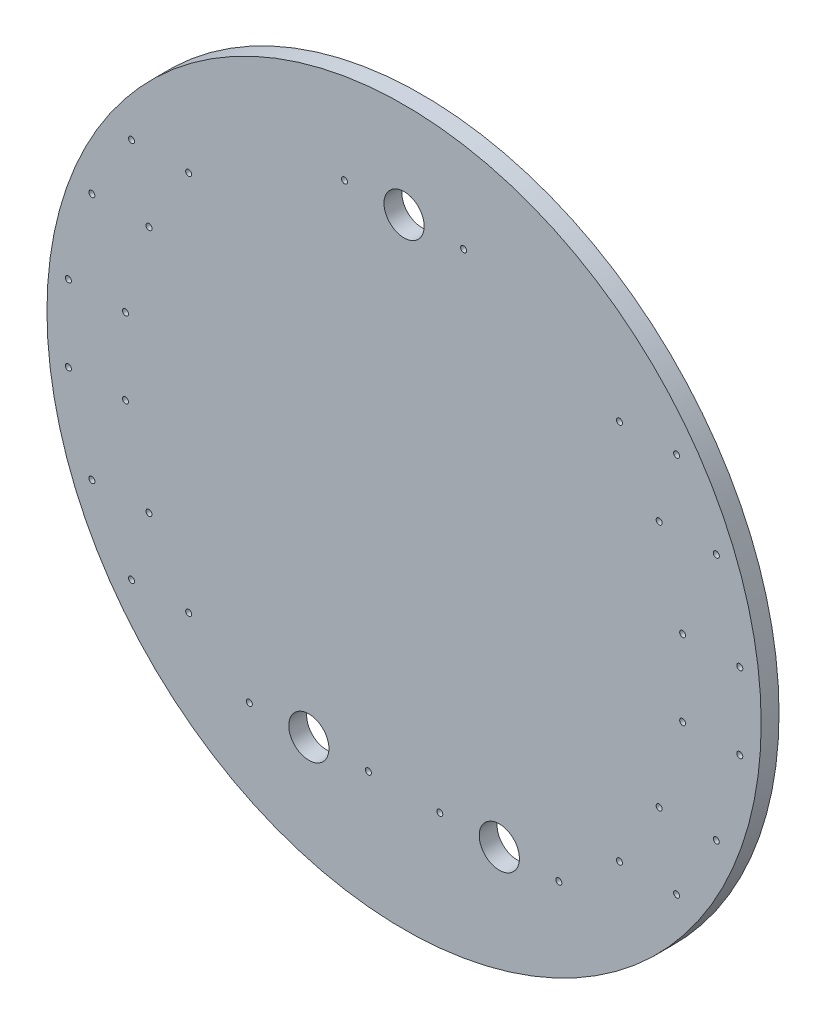
ISO-10303-21;
HEADER;
FILE_DESCRIPTION(('STEP AP214'),'2;1');
FILE_NAME('part.step','',(''),(''),'','','');
FILE_SCHEMA(('AUTOMOTIVE_DESIGN { 1 0 10303 214 1 1 1 1 }'));
ENDSEC;
DATA;
#1=APPLICATION_CONTEXT('core data for automotive mechanical design processes');
#2=APPLICATION_PROTOCOL_DEFINITION('international standard','automotive_design',2000,#1);
#3=PRODUCT_CONTEXT('',#1,'mechanical');
#4=PRODUCT('Part','Part','',(#3));
#5=PRODUCT_RELATED_PRODUCT_CATEGORY('part','',(#4));
#6=PRODUCT_DEFINITION_FORMATION('','',#4);
#7=PRODUCT_DEFINITION_CONTEXT('part definition',#1,'design');
#8=PRODUCT_DEFINITION('design','',#6,#7);
#9=PRODUCT_DEFINITION_SHAPE('','',#8);
#10=(LENGTH_UNIT() NAMED_UNIT(*) SI_UNIT(.MILLI.,.METRE.));
#11=(NAMED_UNIT(*) PLANE_ANGLE_UNIT() SI_UNIT($,.RADIAN.));
#12=(NAMED_UNIT(*) SI_UNIT($,.STERADIAN.) SOLID_ANGLE_UNIT());
#13=UNCERTAINTY_MEASURE_WITH_UNIT(LENGTH_MEASURE(1.E-05),#10,'distance_accuracy_value','');
#14=(GEOMETRIC_REPRESENTATION_CONTEXT(3) GLOBAL_UNCERTAINTY_ASSIGNED_CONTEXT((#13)) GLOBAL_UNIT_ASSIGNED_CONTEXT((#10,
#11,#12)) REPRESENTATION_CONTEXT('',''));
#15=CARTESIAN_POINT('',(0.,0.,0.));
#16=DIRECTION('',(0.,0.,1.));
#17=DIRECTION('',(1.,0.,0.));
#18=AXIS2_PLACEMENT_3D('',#15,#16,#17);
#19=CARTESIAN_POINT('',(0.,0.,4.7625));
#20=DIRECTION('',(0.,0.,-1.));
#21=DIRECTION('',(-1.,0.,0.));
#22=AXIS2_PLACEMENT_3D('',#19,#20,#21);
#23=CYLINDRICAL_SURFACE('',#22,95.25);
#24=CARTESIAN_POINT('',(0.,0.,4.7625));
#25=DIRECTION('',(0.,0.,1.));
#26=DIRECTION('',(1.,0.,0.));
#27=AXIS2_PLACEMENT_3D('',#24,#25,#26);
#28=CIRCLE('',#27,95.25);
#29=CARTESIAN_POINT('',(95.25,0.,4.7625));
#30=VERTEX_POINT('',#29);
#31=EDGE_CURVE('E10',#30,#30,#28,.T.);
#32=ORIENTED_EDGE('',*,*,#31,.F.);
#33=EDGE_LOOP('',(#32));
#34=FACE_BOUND('',#33,.T.);
#35=CARTESIAN_POINT('',(0.,0.,0.));
#36=DIRECTION('',(0.,0.,1.));
#37=DIRECTION('',(1.,0.,0.));
#38=AXIS2_PLACEMENT_3D('',#35,#36,#37);
#39=CIRCLE('',#38,95.25);
#40=CARTESIAN_POINT('',(95.25,0.,0.));
#41=VERTEX_POINT('',#40);
#42=EDGE_CURVE('E42',#41,#41,#39,.T.);
#43=ORIENTED_EDGE('',*,*,#42,.T.);
#44=EDGE_LOOP('',(#43));
#45=FACE_BOUND('',#44,.T.);
#46=ADVANCED_FACE('F35',(#34,#45),#23,.T.);
#47=CARTESIAN_POINT('',(0.,0.,4.7625));
#48=DIRECTION('',(0.,0.,1.));
#49=DIRECTION('',(1.,0.,0.));
#50=AXIS2_PLACEMENT_3D('',#47,#48,#49);
#51=PLANE('',#50);
#52=CARTESIAN_POINT('',(0.,69.85,4.7625));
#53=DIRECTION('',(0.,0.,1.));
#54=DIRECTION('',(1.,0.,0.));
#55=AXIS2_PLACEMENT_3D('',#52,#53,#54);
#56=CIRCLE('',#55,5.35813);
#57=CARTESIAN_POINT('',(5.35813,69.85,4.7625));
#58=VERTEX_POINT('',#57);
#59=EDGE_CURVE('E264',#58,#58,#56,.T.);
#60=ORIENTED_EDGE('',*,*,#59,.F.);
#61=EDGE_LOOP('',(#60));
#62=FACE_BOUND('',#61,.T.);
#63=CARTESIAN_POINT('',(-25.4,-63.5,4.7625));
#64=DIRECTION('',(0.,0.,1.));
#65=DIRECTION('',(1.,0.,0.));
#66=AXIS2_PLACEMENT_3D('',#63,#64,#65);
#67=CIRCLE('',#66,5.35813);
#68=CARTESIAN_POINT('',(-20.04187,-63.5,4.7625));
#69=VERTEX_POINT('',#68);
#70=EDGE_CURVE('E268',#69,#69,#67,.T.);
#71=ORIENTED_EDGE('',*,*,#70,.F.);
#72=EDGE_LOOP('',(#71));
#73=FACE_BOUND('',#72,.T.);
#74=CARTESIAN_POINT('',(25.4,-63.5,4.7625));
#75=DIRECTION('',(0.,0.,1.));
#76=DIRECTION('',(1.,0.,0.));
#77=AXIS2_PLACEMENT_3D('',#74,#75,#76);
#78=CIRCLE('',#77,5.35813);
#79=CARTESIAN_POINT('',(30.75813,-63.5,4.7625));
#80=VERTEX_POINT('',#79);
#81=EDGE_CURVE('E272',#80,#80,#78,.T.);
#82=ORIENTED_EDGE('',*,*,#81,.F.);
#83=EDGE_LOOP('',(#82));
#84=FACE_BOUND('',#83,.T.);
#85=CARTESIAN_POINT('',(-41.275,-63.5,4.7625));
#86=DIRECTION('',(0.,0.,1.));
#87=DIRECTION('',(1.,0.,0.));
#88=AXIS2_PLACEMENT_3D('',#85,#86,#87);
#89=CIRCLE('',#88,0.799999999999988);
#90=CARTESIAN_POINT('',(-40.475,-63.5,4.7625));
#91=VERTEX_POINT('',#90);
#92=EDGE_CURVE('E114',#91,#91,#89,.T.);
#93=ORIENTED_EDGE('',*,*,#92,.F.);
#94=EDGE_LOOP('',(#93));
#95=FACE_BOUND('',#94,.T.);
#96=CARTESIAN_POINT('',(-9.52499999999998,-63.5,4.7625));
#97=DIRECTION('',(0.,0.,1.));
#98=DIRECTION('',(1.,0.,0.));
#99=AXIS2_PLACEMENT_3D('',#96,#97,#98);
#100=CIRCLE('',#99,0.79999999999999);
#101=CARTESIAN_POINT('',(-8.72499999999999,-63.5,4.7625));
#102=VERTEX_POINT('',#101);
#103=EDGE_CURVE('E103',#102,#102,#100,.T.);
#104=ORIENTED_EDGE('',*,*,#103,.F.);
#105=EDGE_LOOP('',(#104));
#106=FACE_BOUND('',#105,.T.);
#107=CARTESIAN_POINT('',(9.525,-63.5,4.7625));
#108=DIRECTION('',(0.,0.,1.));
#109=DIRECTION('',(1.,0.,0.));
#110=AXIS2_PLACEMENT_3D('',#107,#108,#109);
#111=CIRCLE('',#110,0.79999999999999);
#112=CARTESIAN_POINT('',(10.325,-63.5,4.7625));
#113=VERTEX_POINT('',#112);
#114=EDGE_CURVE('E100',#113,#113,#111,.T.);
#115=ORIENTED_EDGE('',*,*,#114,.F.);
#116=EDGE_LOOP('',(#115));
#117=FACE_BOUND('',#116,.T.);
#118=CARTESIAN_POINT('',(41.275,-63.5,4.7625));
#119=DIRECTION('',(0.,0.,1.));
#120=DIRECTION('',(1.,0.,0.));
#121=AXIS2_PLACEMENT_3D('',#118,#119,#120);
#122=CIRCLE('',#121,0.799999999999988);
#123=CARTESIAN_POINT('',(42.075,-63.5,4.7625));
#124=VERTEX_POINT('',#123);
#125=EDGE_CURVE('E97',#124,#124,#122,.T.);
#126=ORIENTED_EDGE('',*,*,#125,.F.);
#127=EDGE_LOOP('',(#126));
#128=FACE_BOUND('',#127,.T.);
#129=CARTESIAN_POINT('',(-15.875,69.85,4.7625));
#130=DIRECTION('',(0.,0.,1.));
#131=DIRECTION('',(1.,0.,0.));
#132=AXIS2_PLACEMENT_3D('',#129,#130,#131);
#133=CIRCLE('',#132,0.79999999999999);
#134=CARTESIAN_POINT('',(-15.075,69.85,4.7625));
#135=VERTEX_POINT('',#134);
#136=EDGE_CURVE('E93',#135,#135,#133,.T.);
#137=ORIENTED_EDGE('',*,*,#136,.F.);
#138=EDGE_LOOP('',(#137));
#139=FACE_BOUND('',#138,.T.);
#140=CARTESIAN_POINT('',(15.875,69.85,4.7625));
#141=DIRECTION('',(0.,0.,1.));
#142=DIRECTION('',(1.,0.,0.));
#143=AXIS2_PLACEMENT_3D('',#140,#141,#142);
#144=CIRCLE('',#143,0.799999999999988);
#145=CARTESIAN_POINT('',(16.675,69.85,4.7625));
#146=VERTEX_POINT('',#145);
#147=EDGE_CURVE('E92',#146,#146,#144,.T.);
#148=ORIENTED_EDGE('',*,*,#147,.F.);
#149=EDGE_LOOP('',(#148));
#150=FACE_BOUND('',#149,.T.);
#151=CARTESIAN_POINT('',(-83.2783247237209,33.02,4.7625));
#152=DIRECTION('',(0.,0.,1.));
#153=DIRECTION('',(1.,0.,0.));
#154=AXIS2_PLACEMENT_3D('',#151,#152,#153);
#155=CIRCLE('',#154,0.799999999999995);
#156=CARTESIAN_POINT('',(-82.4783247237209,33.02,4.7625));
#157=VERTEX_POINT('',#156);
#158=EDGE_CURVE('E127',#157,#157,#155,.T.);
#159=ORIENTED_EDGE('',*,*,#158,.F.);
#160=EDGE_LOOP('',(#159));
#161=FACE_BOUND('',#160,.T.);
#162=CARTESIAN_POINT('',(-68.0383247237209,33.02,4.7625));
#163=DIRECTION('',(0.,0.,1.));
#164=DIRECTION('',(1.,0.,0.));
#165=AXIS2_PLACEMENT_3D('',#162,#163,#164);
#166=CIRCLE('',#165,0.799999999999995);
#167=CARTESIAN_POINT('',(-67.2383247237209,33.02,4.7625));
#168=VERTEX_POINT('',#167);
#169=EDGE_CURVE('E133',#168,#168,#166,.T.);
#170=ORIENTED_EDGE('',*,*,#169,.F.);
#171=EDGE_LOOP('',(#170));
#172=FACE_BOUND('',#171,.T.);
#173=CARTESIAN_POINT('',(-72.6881373638435,50.8,4.7625));
#174=DIRECTION('',(0.,0.,1.));
#175=DIRECTION('',(1.,0.,0.));
#176=AXIS2_PLACEMENT_3D('',#173,#174,#175);
#177=CIRCLE('',#176,0.799999999999995);
#178=CARTESIAN_POINT('',(-71.8881373638435,50.8,4.7625));
#179=VERTEX_POINT('',#178);
#180=EDGE_CURVE('E139',#179,#179,#177,.T.);
#181=ORIENTED_EDGE('',*,*,#180,.F.);
#182=EDGE_LOOP('',(#181));
#183=FACE_BOUND('',#182,.T.);
#184=CARTESIAN_POINT('',(-57.4481373638435,50.8,4.7625));
#185=DIRECTION('',(0.,0.,1.));
#186=DIRECTION('',(1.,0.,0.));
#187=AXIS2_PLACEMENT_3D('',#184,#185,#186);
#188=CIRCLE('',#187,0.800000000000002);
#189=CARTESIAN_POINT('',(-56.6481373638434,50.8,4.7625));
#190=VERTEX_POINT('',#189);
#191=EDGE_CURVE('E145',#190,#190,#188,.T.);
#192=ORIENTED_EDGE('',*,*,#191,.F.);
#193=EDGE_LOOP('',(#192));
#194=FACE_BOUND('',#193,.T.);
#195=CARTESIAN_POINT('',(-89.5423833881803,10.16,4.7625));
#196=DIRECTION('',(0.,0.,1.));
#197=DIRECTION('',(1.,0.,0.));
#198=AXIS2_PLACEMENT_3D('',#195,#196,#197);
#199=CIRCLE('',#198,0.799999999999995);
#200=CARTESIAN_POINT('',(-88.7423833881803,10.16,4.7625));
#201=VERTEX_POINT('',#200);
#202=EDGE_CURVE('E88',#201,#201,#199,.T.);
#203=ORIENTED_EDGE('',*,*,#202,.F.);
#204=EDGE_LOOP('',(#203));
#205=FACE_BOUND('',#204,.T.);
#206=CARTESIAN_POINT('',(-74.3023833881803,10.16,4.7625));
#207=DIRECTION('',(0.,0.,1.));
#208=DIRECTION('',(1.,0.,0.));
#209=AXIS2_PLACEMENT_3D('',#206,#207,#208);
#210=CIRCLE('',#209,0.799999999999995);
#211=CARTESIAN_POINT('',(-73.5023833881803,10.16,4.7625));
#212=VERTEX_POINT('',#211);
#213=EDGE_CURVE('E84',#212,#212,#210,.T.);
#214=ORIENTED_EDGE('',*,*,#213,.F.);
#215=EDGE_LOOP('',(#214));
#216=FACE_BOUND('',#215,.T.);
#217=CARTESIAN_POINT('',(-57.4481373638434,-50.8,4.7625));
#218=DIRECTION('',(0.,0.,1.));
#219=DIRECTION('',(1.,0.,0.));
#220=AXIS2_PLACEMENT_3D('',#217,#218,#219);
#221=CIRCLE('',#220,0.800000000000002);
#222=CARTESIAN_POINT('',(-56.6481373638434,-50.8,4.7625));
#223=VERTEX_POINT('',#222);
#224=EDGE_CURVE('E83',#223,#223,#221,.T.);
#225=ORIENTED_EDGE('',*,*,#224,.F.);
#226=EDGE_LOOP('',(#225));
#227=FACE_BOUND('',#226,.T.);
#228=CARTESIAN_POINT('',(-72.6881373638434,-50.8,4.7625));
#229=DIRECTION('',(0.,0.,1.));
#230=DIRECTION('',(1.,0.,0.));
#231=AXIS2_PLACEMENT_3D('',#228,#229,#230);
#232=CIRCLE('',#231,0.799999999999995);
#233=CARTESIAN_POINT('',(-71.8881373638434,-50.8,4.7625));
#234=VERTEX_POINT('',#233);
#235=EDGE_CURVE('E160',#234,#234,#232,.T.);
#236=ORIENTED_EDGE('',*,*,#235,.F.);
#237=EDGE_LOOP('',(#236));
#238=FACE_BOUND('',#237,.T.);
#239=CARTESIAN_POINT('',(-68.0383247237209,-33.02,4.7625));
#240=DIRECTION('',(0.,0.,1.));
#241=DIRECTION('',(1.,0.,0.));
#242=AXIS2_PLACEMENT_3D('',#239,#240,#241);
#243=CIRCLE('',#242,0.799999999999995);
#244=CARTESIAN_POINT('',(-67.2383247237209,-33.02,4.7625));
#245=VERTEX_POINT('',#244);
#246=EDGE_CURVE('E166',#245,#245,#243,.T.);
#247=ORIENTED_EDGE('',*,*,#246,.F.);
#248=EDGE_LOOP('',(#247));
#249=FACE_BOUND('',#248,.T.);
#250=CARTESIAN_POINT('',(-83.2783247237209,-33.02,4.7625));
#251=DIRECTION('',(0.,0.,1.));
#252=DIRECTION('',(1.,0.,0.));
#253=AXIS2_PLACEMENT_3D('',#250,#251,#252);
#254=CIRCLE('',#253,0.799999999999995);
#255=CARTESIAN_POINT('',(-82.4783247237209,-33.02,4.7625));
#256=VERTEX_POINT('',#255);
#257=EDGE_CURVE('E172',#256,#256,#254,.T.);
#258=ORIENTED_EDGE('',*,*,#257,.F.);
#259=EDGE_LOOP('',(#258));
#260=FACE_BOUND('',#259,.T.);
#261=CARTESIAN_POINT('',(-74.3023833881803,-10.16,4.7625));
#262=DIRECTION('',(0.,0.,1.));
#263=DIRECTION('',(1.,0.,0.));
#264=AXIS2_PLACEMENT_3D('',#261,#262,#263);
#265=CIRCLE('',#264,0.799999999999995);
#266=CARTESIAN_POINT('',(-73.5023833881803,-10.16,4.7625));
#267=VERTEX_POINT('',#266);
#268=EDGE_CURVE('E178',#267,#267,#265,.T.);
#269=ORIENTED_EDGE('',*,*,#268,.F.);
#270=EDGE_LOOP('',(#269));
#271=FACE_BOUND('',#270,.T.);
#272=CARTESIAN_POINT('',(-89.5423833881803,-10.16,4.7625));
#273=DIRECTION('',(0.,0.,1.));
#274=DIRECTION('',(1.,0.,0.));
#275=AXIS2_PLACEMENT_3D('',#272,#273,#274);
#276=CIRCLE('',#275,0.799999999999995);
#277=CARTESIAN_POINT('',(-88.7423833881803,-10.16,4.7625));
#278=VERTEX_POINT('',#277);
#279=EDGE_CURVE('E79',#278,#278,#276,.T.);
#280=ORIENTED_EDGE('',*,*,#279,.F.);
#281=EDGE_LOOP('',(#280));
#282=FACE_BOUND('',#281,.T.);
#283=CARTESIAN_POINT('',(57.4481373638434,-50.8,4.7625));
#284=DIRECTION('',(0.,0.,1.));
#285=DIRECTION('',(1.,0.,0.));
#286=AXIS2_PLACEMENT_3D('',#283,#284,#285);
#287=CIRCLE('',#286,0.800000000000002);
#288=CARTESIAN_POINT('',(58.2481373638434,-50.8,4.7625));
#289=VERTEX_POINT('',#288);
#290=EDGE_CURVE('E78',#289,#289,#287,.T.);
#291=ORIENTED_EDGE('',*,*,#290,.F.);
#292=EDGE_LOOP('',(#291));
#293=FACE_BOUND('',#292,.T.);
#294=CARTESIAN_POINT('',(72.6881373638434,-50.8,4.7625));
#295=DIRECTION('',(0.,0.,1.));
#296=DIRECTION('',(1.,0.,0.));
#297=AXIS2_PLACEMENT_3D('',#294,#295,#296);
#298=CIRCLE('',#297,0.799999999999995);
#299=CARTESIAN_POINT('',(73.4881373638434,-50.8,4.7625));
#300=VERTEX_POINT('',#299);
#301=EDGE_CURVE('E74',#300,#300,#298,.T.);
#302=ORIENTED_EDGE('',*,*,#301,.F.);
#303=EDGE_LOOP('',(#302));
#304=FACE_BOUND('',#303,.T.);
#305=CARTESIAN_POINT('',(68.0383247237209,-33.02,4.7625));
#306=DIRECTION('',(0.,0.,1.));
#307=DIRECTION('',(1.,0.,0.));
#308=AXIS2_PLACEMENT_3D('',#305,#306,#307);
#309=CIRCLE('',#308,0.799999999999995);
#310=CARTESIAN_POINT('',(68.8383247237209,-33.02,4.7625));
#311=VERTEX_POINT('',#310);
#312=EDGE_CURVE('E73',#311,#311,#309,.T.);
#313=ORIENTED_EDGE('',*,*,#312,.F.);
#314=EDGE_LOOP('',(#313));
#315=FACE_BOUND('',#314,.T.);
#316=CARTESIAN_POINT('',(83.2783247237209,-33.02,4.7625));
#317=DIRECTION('',(0.,0.,1.));
#318=DIRECTION('',(1.,0.,0.));
#319=AXIS2_PLACEMENT_3D('',#316,#317,#318);
#320=CIRCLE('',#319,0.799999999999995);
#321=CARTESIAN_POINT('',(84.0783247237209,-33.02,4.7625));
#322=VERTEX_POINT('',#321);
#323=EDGE_CURVE('E69',#322,#322,#320,.T.);
#324=ORIENTED_EDGE('',*,*,#323,.F.);
#325=EDGE_LOOP('',(#324));
#326=FACE_BOUND('',#325,.T.);
#327=CARTESIAN_POINT('',(89.5423833881803,-10.16,4.7625));
#328=DIRECTION('',(0.,0.,1.));
#329=DIRECTION('',(1.,0.,0.));
#330=AXIS2_PLACEMENT_3D('',#327,#328,#329);
#331=CIRCLE('',#330,0.799999999999995);
#332=CARTESIAN_POINT('',(90.3423833881803,-10.16,4.7625));
#333=VERTEX_POINT('',#332);
#334=EDGE_CURVE('E65',#333,#333,#331,.T.);
#335=ORIENTED_EDGE('',*,*,#334,.F.);
#336=EDGE_LOOP('',(#335));
#337=FACE_BOUND('',#336,.T.);
#338=CARTESIAN_POINT('',(74.3023833881803,-10.16,4.7625));
#339=DIRECTION('',(0.,0.,1.));
#340=DIRECTION('',(1.,0.,0.));
#341=AXIS2_PLACEMENT_3D('',#338,#339,#340);
#342=CIRCLE('',#341,0.799999999999995);
#343=CARTESIAN_POINT('',(75.1023833881803,-10.16,4.7625));
#344=VERTEX_POINT('',#343);
#345=EDGE_CURVE('E61',#344,#344,#342,.T.);
#346=ORIENTED_EDGE('',*,*,#345,.F.);
#347=EDGE_LOOP('',(#346));
#348=FACE_BOUND('',#347,.T.);
#349=CARTESIAN_POINT('',(89.5423833881803,10.16,4.7625));
#350=DIRECTION('',(0.,0.,1.));
#351=DIRECTION('',(1.,0.,0.));
#352=AXIS2_PLACEMENT_3D('',#349,#350,#351);
#353=CIRCLE('',#352,0.799999999999995);
#354=CARTESIAN_POINT('',(90.3423833881803,10.16,4.7625));
#355=VERTEX_POINT('',#354);
#356=EDGE_CURVE('E60',#355,#355,#353,.T.);
#357=ORIENTED_EDGE('',*,*,#356,.F.);
#358=EDGE_LOOP('',(#357));
#359=FACE_BOUND('',#358,.T.);
#360=CARTESIAN_POINT('',(74.3023833881803,10.16,4.7625));
#361=DIRECTION('',(0.,0.,1.));
#362=DIRECTION('',(1.,0.,0.));
#363=AXIS2_PLACEMENT_3D('',#360,#361,#362);
#364=CIRCLE('',#363,0.799999999999995);
#365=CARTESIAN_POINT('',(75.1023833881803,10.16,4.7625));
#366=VERTEX_POINT('',#365);
#367=EDGE_CURVE('E56',#366,#366,#364,.T.);
#368=ORIENTED_EDGE('',*,*,#367,.F.);
#369=EDGE_LOOP('',(#368));
#370=FACE_BOUND('',#369,.T.);
#371=CARTESIAN_POINT('',(83.2783247237209,33.02,4.7625));
#372=DIRECTION('',(0.,0.,1.));
#373=DIRECTION('',(1.,0.,0.));
#374=AXIS2_PLACEMENT_3D('',#371,#372,#373);
#375=CIRCLE('',#374,0.799999999999995);
#376=CARTESIAN_POINT('',(84.0783247237209,33.02,4.7625));
#377=VERTEX_POINT('',#376);
#378=EDGE_CURVE('E55',#377,#377,#375,.T.);
#379=ORIENTED_EDGE('',*,*,#378,.F.);
#380=EDGE_LOOP('',(#379));
#381=FACE_BOUND('',#380,.T.);
#382=CARTESIAN_POINT('',(68.0383247237209,33.02,4.7625));
#383=DIRECTION('',(0.,0.,1.));
#384=DIRECTION('',(1.,0.,0.));
#385=AXIS2_PLACEMENT_3D('',#382,#383,#384);
#386=CIRCLE('',#385,0.799999999999995);
#387=CARTESIAN_POINT('',(68.8383247237209,33.02,4.7625));
#388=VERTEX_POINT('',#387);
#389=EDGE_CURVE('E216',#388,#388,#386,.T.);
#390=ORIENTED_EDGE('',*,*,#389,.F.);
#391=EDGE_LOOP('',(#390));
#392=FACE_BOUND('',#391,.T.);
#393=CARTESIAN_POINT('',(57.4481373638434,50.8,4.7625));
#394=DIRECTION('',(0.,0.,1.));
#395=DIRECTION('',(1.,0.,0.));
#396=AXIS2_PLACEMENT_3D('',#393,#394,#395);
#397=CIRCLE('',#396,0.800000000000002);
#398=CARTESIAN_POINT('',(58.2481373638434,50.8,4.7625));
#399=VERTEX_POINT('',#398);
#400=EDGE_CURVE('E222',#399,#399,#397,.T.);
#401=ORIENTED_EDGE('',*,*,#400,.F.);
#402=EDGE_LOOP('',(#401));
#403=FACE_BOUND('',#402,.T.);
#404=CARTESIAN_POINT('',(72.6881373638434,50.8,4.7625));
#405=DIRECTION('',(0.,0.,1.));
#406=DIRECTION('',(1.,0.,0.));
#407=AXIS2_PLACEMENT_3D('',#404,#405,#406);
#408=CIRCLE('',#407,0.799999999999995);
#409=CARTESIAN_POINT('',(73.4881373638434,50.8,4.7625));
#410=VERTEX_POINT('',#409);
#411=EDGE_CURVE('E227',#410,#410,#408,.T.);
#412=ORIENTED_EDGE('',*,*,#411,.F.);
#413=EDGE_LOOP('',(#412));
#414=FACE_BOUND('',#413,.T.);
#415=ORIENTED_EDGE('',*,*,#31,.T.);
#416=EDGE_LOOP('',(#415));
#417=FACE_BOUND('',#416,.T.);
#418=ADVANCED_FACE('F248',(#62,#73,#84,#95,#106,#117,#128,#139,#150,#161,#172,#183,#194,#205,
#216,#227,#238,#249,#260,#271,#282,#293,#304,#315,#326,#337,#348,#359,#370,#381,#392,#403,#414,
#417),#51,.T.);
#419=CARTESIAN_POINT('',(0.,0.,0.));
#420=DIRECTION('',(0.,0.,1.));
#421=DIRECTION('',(1.,0.,0.));
#422=AXIS2_PLACEMENT_3D('',#419,#420,#421);
#423=PLANE('',#422);
#424=CARTESIAN_POINT('',(0.,69.85,0.));
#425=DIRECTION('',(0.,0.,1.));
#426=DIRECTION('',(1.,0.,0.));
#427=AXIS2_PLACEMENT_3D('',#424,#425,#426);
#428=CIRCLE('',#427,5.35813);
#429=CARTESIAN_POINT('',(5.35813,69.85,0.));
#430=VERTEX_POINT('',#429);
#431=EDGE_CURVE('E466',#430,#430,#428,.T.);
#432=ORIENTED_EDGE('',*,*,#431,.T.);
#433=EDGE_LOOP('',(#432));
#434=FACE_BOUND('',#433,.T.);
#435=CARTESIAN_POINT('',(-25.4,-63.5,0.));
#436=DIRECTION('',(0.,0.,1.));
#437=DIRECTION('',(1.,0.,0.));
#438=AXIS2_PLACEMENT_3D('',#435,#436,#437);
#439=CIRCLE('',#438,5.35813);
#440=CARTESIAN_POINT('',(-20.04187,-63.5,0.));
#441=VERTEX_POINT('',#440);
#442=EDGE_CURVE('E468',#441,#441,#439,.T.);
#443=ORIENTED_EDGE('',*,*,#442,.T.);
#444=EDGE_LOOP('',(#443));
#445=FACE_BOUND('',#444,.T.);
#446=CARTESIAN_POINT('',(25.4,-63.5,0.));
#447=DIRECTION('',(0.,0.,1.));
#448=DIRECTION('',(1.,0.,0.));
#449=AXIS2_PLACEMENT_3D('',#446,#447,#448);
#450=CIRCLE('',#449,5.35813);
#451=CARTESIAN_POINT('',(30.75813,-63.5,0.));
#452=VERTEX_POINT('',#451);
#453=EDGE_CURVE('E38',#452,#452,#450,.T.);
#454=ORIENTED_EDGE('',*,*,#453,.T.);
#455=EDGE_LOOP('',(#454));
#456=FACE_BOUND('',#455,.T.);
#457=CARTESIAN_POINT('',(-41.275,-63.5,0.));
#458=DIRECTION('',(0.,0.,1.));
#459=DIRECTION('',(1.,0.,0.));
#460=AXIS2_PLACEMENT_3D('',#457,#458,#459);
#461=CIRCLE('',#460,0.799999999999988);
#462=CARTESIAN_POINT('',(-40.475,-63.5,0.));
#463=VERTEX_POINT('',#462);
#464=EDGE_CURVE('E109',#463,#463,#461,.T.);
#465=ORIENTED_EDGE('',*,*,#464,.T.);
#466=EDGE_LOOP('',(#465));
#467=FACE_BOUND('',#466,.T.);
#468=CARTESIAN_POINT('',(-9.52499999999998,-63.5,0.));
#469=DIRECTION('',(0.,0.,1.));
#470=DIRECTION('',(1.,0.,0.));
#471=AXIS2_PLACEMENT_3D('',#468,#469,#470);
#472=CIRCLE('',#471,0.799999999999989);
#473=CARTESIAN_POINT('',(-8.725,-63.5,0.));
#474=VERTEX_POINT('',#473);
#475=EDGE_CURVE('E101',#474,#474,#472,.T.);
#476=ORIENTED_EDGE('',*,*,#475,.T.);
#477=EDGE_LOOP('',(#476));
#478=FACE_BOUND('',#477,.T.);
#479=CARTESIAN_POINT('',(9.525,-63.5,0.));
#480=DIRECTION('',(0.,0.,1.));
#481=DIRECTION('',(1.,0.,0.));
#482=AXIS2_PLACEMENT_3D('',#479,#480,#481);
#483=CIRCLE('',#482,0.799999999999989);
#484=CARTESIAN_POINT('',(10.325,-63.5,0.));
#485=VERTEX_POINT('',#484);
#486=EDGE_CURVE('E98',#485,#485,#483,.T.);
#487=ORIENTED_EDGE('',*,*,#486,.T.);
#488=EDGE_LOOP('',(#487));
#489=FACE_BOUND('',#488,.T.);
#490=CARTESIAN_POINT('',(41.275,-63.5,0.));
#491=DIRECTION('',(0.,0.,1.));
#492=DIRECTION('',(1.,0.,0.));
#493=AXIS2_PLACEMENT_3D('',#490,#491,#492);
#494=CIRCLE('',#493,0.799999999999988);
#495=CARTESIAN_POINT('',(42.075,-63.5,0.));
#496=VERTEX_POINT('',#495);
#497=EDGE_CURVE('E94',#496,#496,#494,.T.);
#498=ORIENTED_EDGE('',*,*,#497,.T.);
#499=EDGE_LOOP('',(#498));
#500=FACE_BOUND('',#499,.T.);
#501=CARTESIAN_POINT('',(-15.875,69.85,0.));
#502=DIRECTION('',(0.,0.,1.));
#503=DIRECTION('',(1.,0.,0.));
#504=AXIS2_PLACEMENT_3D('',#501,#502,#503);
#505=CIRCLE('',#504,0.799999999999989);
#506=CARTESIAN_POINT('',(-15.075,69.85,0.));
#507=VERTEX_POINT('',#506);
#508=EDGE_CURVE('E89',#507,#507,#505,.T.);
#509=ORIENTED_EDGE('',*,*,#508,.T.);
#510=EDGE_LOOP('',(#509));
#511=FACE_BOUND('',#510,.T.);
#512=CARTESIAN_POINT('',(15.875,69.85,0.));
#513=DIRECTION('',(0.,0.,1.));
#514=DIRECTION('',(1.,0.,0.));
#515=AXIS2_PLACEMENT_3D('',#512,#513,#514);
#516=CIRCLE('',#515,0.799999999999988);
#517=CARTESIAN_POINT('',(16.675,69.85,0.));
#518=VERTEX_POINT('',#517);
#519=EDGE_CURVE('E124',#518,#518,#516,.T.);
#520=ORIENTED_EDGE('',*,*,#519,.T.);
#521=EDGE_LOOP('',(#520));
#522=FACE_BOUND('',#521,.T.);
#523=CARTESIAN_POINT('',(-83.2783247237209,33.02,0.));
#524=DIRECTION('',(0.,0.,1.));
#525=DIRECTION('',(1.,0.,0.));
#526=AXIS2_PLACEMENT_3D('',#523,#524,#525);
#527=CIRCLE('',#526,0.799999999999995);
#528=CARTESIAN_POINT('',(-82.4783247237209,33.02,0.));
#529=VERTEX_POINT('',#528);
#530=EDGE_CURVE('E130',#529,#529,#527,.T.);
#531=ORIENTED_EDGE('',*,*,#530,.T.);
#532=EDGE_LOOP('',(#531));
#533=FACE_BOUND('',#532,.T.);
#534=CARTESIAN_POINT('',(-68.0383247237209,33.02,0.));
#535=DIRECTION('',(0.,0.,1.));
#536=DIRECTION('',(1.,0.,0.));
#537=AXIS2_PLACEMENT_3D('',#534,#535,#536);
#538=CIRCLE('',#537,0.799999999999995);
#539=CARTESIAN_POINT('',(-67.2383247237209,33.02,0.));
#540=VERTEX_POINT('',#539);
#541=EDGE_CURVE('E136',#540,#540,#538,.T.);
#542=ORIENTED_EDGE('',*,*,#541,.T.);
#543=EDGE_LOOP('',(#542));
#544=FACE_BOUND('',#543,.T.);
#545=CARTESIAN_POINT('',(-72.6881373638435,50.8,0.));
#546=DIRECTION('',(0.,0.,1.));
#547=DIRECTION('',(1.,0.,0.));
#548=AXIS2_PLACEMENT_3D('',#545,#546,#547);
#549=CIRCLE('',#548,0.799999999999995);
#550=CARTESIAN_POINT('',(-71.8881373638435,50.8,0.));
#551=VERTEX_POINT('',#550);
#552=EDGE_CURVE('E142',#551,#551,#549,.T.);
#553=ORIENTED_EDGE('',*,*,#552,.T.);
#554=EDGE_LOOP('',(#553));
#555=FACE_BOUND('',#554,.T.);
#556=CARTESIAN_POINT('',(-57.4481373638435,50.8,0.));
#557=DIRECTION('',(0.,0.,1.));
#558=DIRECTION('',(1.,0.,0.));
#559=AXIS2_PLACEMENT_3D('',#556,#557,#558);
#560=CIRCLE('',#559,0.800000000000002);
#561=CARTESIAN_POINT('',(-56.6481373638434,50.8,0.));
#562=VERTEX_POINT('',#561);
#563=EDGE_CURVE('E148',#562,#562,#560,.T.);
#564=ORIENTED_EDGE('',*,*,#563,.T.);
#565=EDGE_LOOP('',(#564));
#566=FACE_BOUND('',#565,.T.);
#567=CARTESIAN_POINT('',(-89.5423833881803,10.16,0.));
#568=DIRECTION('',(0.,0.,1.));
#569=DIRECTION('',(1.,0.,0.));
#570=AXIS2_PLACEMENT_3D('',#567,#568,#569);
#571=CIRCLE('',#570,0.799999999999995);
#572=CARTESIAN_POINT('',(-88.7423833881803,10.16,0.));
#573=VERTEX_POINT('',#572);
#574=EDGE_CURVE('E85',#573,#573,#571,.T.);
#575=ORIENTED_EDGE('',*,*,#574,.T.);
#576=EDGE_LOOP('',(#575));
#577=FACE_BOUND('',#576,.T.);
#578=CARTESIAN_POINT('',(-74.3023833881803,10.16,0.));
#579=DIRECTION('',(0.,0.,1.));
#580=DIRECTION('',(1.,0.,0.));
#581=AXIS2_PLACEMENT_3D('',#578,#579,#580);
#582=CIRCLE('',#581,0.799999999999995);
#583=CARTESIAN_POINT('',(-73.5023833881803,10.16,0.));
#584=VERTEX_POINT('',#583);
#585=EDGE_CURVE('E80',#584,#584,#582,.T.);
#586=ORIENTED_EDGE('',*,*,#585,.T.);
#587=EDGE_LOOP('',(#586));
#588=FACE_BOUND('',#587,.T.);
#589=CARTESIAN_POINT('',(-57.4481373638434,-50.8,0.));
#590=DIRECTION('',(0.,0.,1.));
#591=DIRECTION('',(1.,0.,0.));
#592=AXIS2_PLACEMENT_3D('',#589,#590,#591);
#593=CIRCLE('',#592,0.800000000000002);
#594=CARTESIAN_POINT('',(-56.6481373638434,-50.8,0.));
#595=VERTEX_POINT('',#594);
#596=EDGE_CURVE('E157',#595,#595,#593,.T.);
#597=ORIENTED_EDGE('',*,*,#596,.T.);
#598=EDGE_LOOP('',(#597));
#599=FACE_BOUND('',#598,.T.);
#600=CARTESIAN_POINT('',(-72.6881373638434,-50.8,0.));
#601=DIRECTION('',(0.,0.,1.));
#602=DIRECTION('',(1.,0.,0.));
#603=AXIS2_PLACEMENT_3D('',#600,#601,#602);
#604=CIRCLE('',#603,0.799999999999995);
#605=CARTESIAN_POINT('',(-71.8881373638434,-50.8,0.));
#606=VERTEX_POINT('',#605);
#607=EDGE_CURVE('E163',#606,#606,#604,.T.);
#608=ORIENTED_EDGE('',*,*,#607,.T.);
#609=EDGE_LOOP('',(#608));
#610=FACE_BOUND('',#609,.T.);
#611=CARTESIAN_POINT('',(-68.0383247237209,-33.02,0.));
#612=DIRECTION('',(0.,0.,1.));
#613=DIRECTION('',(1.,0.,0.));
#614=AXIS2_PLACEMENT_3D('',#611,#612,#613);
#615=CIRCLE('',#614,0.799999999999995);
#616=CARTESIAN_POINT('',(-67.2383247237209,-33.02,0.));
#617=VERTEX_POINT('',#616);
#618=EDGE_CURVE('E169',#617,#617,#615,.T.);
#619=ORIENTED_EDGE('',*,*,#618,.T.);
#620=EDGE_LOOP('',(#619));
#621=FACE_BOUND('',#620,.T.);
#622=CARTESIAN_POINT('',(-83.2783247237209,-33.02,0.));
#623=DIRECTION('',(0.,0.,1.));
#624=DIRECTION('',(1.,0.,0.));
#625=AXIS2_PLACEMENT_3D('',#622,#623,#624);
#626=CIRCLE('',#625,0.799999999999995);
#627=CARTESIAN_POINT('',(-82.4783247237209,-33.02,0.));
#628=VERTEX_POINT('',#627);
#629=EDGE_CURVE('E175',#628,#628,#626,.T.);
#630=ORIENTED_EDGE('',*,*,#629,.T.);
#631=EDGE_LOOP('',(#630));
#632=FACE_BOUND('',#631,.T.);
#633=CARTESIAN_POINT('',(-74.3023833881803,-10.16,0.));
#634=DIRECTION('',(0.,0.,1.));
#635=DIRECTION('',(1.,0.,0.));
#636=AXIS2_PLACEMENT_3D('',#633,#634,#635);
#637=CIRCLE('',#636,0.799999999999995);
#638=CARTESIAN_POINT('',(-73.5023833881803,-10.16,0.));
#639=VERTEX_POINT('',#638);
#640=EDGE_CURVE('E181',#639,#639,#637,.T.);
#641=ORIENTED_EDGE('',*,*,#640,.T.);
#642=EDGE_LOOP('',(#641));
#643=FACE_BOUND('',#642,.T.);
#644=CARTESIAN_POINT('',(-89.5423833881803,-10.16,0.));
#645=DIRECTION('',(0.,0.,1.));
#646=DIRECTION('',(1.,0.,0.));
#647=AXIS2_PLACEMENT_3D('',#644,#645,#646);
#648=CIRCLE('',#647,0.799999999999995);
#649=CARTESIAN_POINT('',(-88.7423833881803,-10.16,0.));
#650=VERTEX_POINT('',#649);
#651=EDGE_CURVE('E75',#650,#650,#648,.T.);
#652=ORIENTED_EDGE('',*,*,#651,.T.);
#653=EDGE_LOOP('',(#652));
#654=FACE_BOUND('',#653,.T.);
#655=CARTESIAN_POINT('',(57.4481373638434,-50.8,0.));
#656=DIRECTION('',(0.,0.,1.));
#657=DIRECTION('',(1.,0.,0.));
#658=AXIS2_PLACEMENT_3D('',#655,#656,#657);
#659=CIRCLE('',#658,0.800000000000002);
#660=CARTESIAN_POINT('',(58.2481373638434,-50.8,0.));
#661=VERTEX_POINT('',#660);
#662=EDGE_CURVE('E188',#661,#661,#659,.T.);
#663=ORIENTED_EDGE('',*,*,#662,.T.);
#664=EDGE_LOOP('',(#663));
#665=FACE_BOUND('',#664,.T.);
#666=CARTESIAN_POINT('',(72.6881373638434,-50.8,0.));
#667=DIRECTION('',(0.,0.,1.));
#668=DIRECTION('',(1.,0.,0.));
#669=AXIS2_PLACEMENT_3D('',#666,#667,#668);
#670=CIRCLE('',#669,0.799999999999995);
#671=CARTESIAN_POINT('',(73.4881373638434,-50.8,0.));
#672=VERTEX_POINT('',#671);
#673=EDGE_CURVE('E70',#672,#672,#670,.T.);
#674=ORIENTED_EDGE('',*,*,#673,.T.);
#675=EDGE_LOOP('',(#674));
#676=FACE_BOUND('',#675,.T.);
#677=CARTESIAN_POINT('',(68.0383247237209,-33.02,0.));
#678=DIRECTION('',(0.,0.,1.));
#679=DIRECTION('',(1.,0.,0.));
#680=AXIS2_PLACEMENT_3D('',#677,#678,#679);
#681=CIRCLE('',#680,0.799999999999995);
#682=CARTESIAN_POINT('',(68.8383247237209,-33.02,0.));
#683=VERTEX_POINT('',#682);
#684=EDGE_CURVE('E195',#683,#683,#681,.T.);
#685=ORIENTED_EDGE('',*,*,#684,.T.);
#686=EDGE_LOOP('',(#685));
#687=FACE_BOUND('',#686,.T.);
#688=CARTESIAN_POINT('',(83.2783247237209,-33.02,0.));
#689=DIRECTION('',(0.,0.,1.));
#690=DIRECTION('',(1.,0.,0.));
#691=AXIS2_PLACEMENT_3D('',#688,#689,#690);
#692=CIRCLE('',#691,0.799999999999995);
#693=CARTESIAN_POINT('',(84.0783247237209,-33.02,0.));
#694=VERTEX_POINT('',#693);
#695=EDGE_CURVE('E66',#694,#694,#692,.T.);
#696=ORIENTED_EDGE('',*,*,#695,.T.);
#697=EDGE_LOOP('',(#696));
#698=FACE_BOUND('',#697,.T.);
#699=CARTESIAN_POINT('',(89.5423833881803,-10.16,0.));
#700=DIRECTION('',(0.,0.,1.));
#701=DIRECTION('',(1.,0.,0.));
#702=AXIS2_PLACEMENT_3D('',#699,#700,#701);
#703=CIRCLE('',#702,0.799999999999995);
#704=CARTESIAN_POINT('',(90.3423833881803,-10.16,0.));
#705=VERTEX_POINT('',#704);
#706=EDGE_CURVE('E62',#705,#705,#703,.T.);
#707=ORIENTED_EDGE('',*,*,#706,.T.);
#708=EDGE_LOOP('',(#707));
#709=FACE_BOUND('',#708,.T.);
#710=CARTESIAN_POINT('',(74.3023833881803,-10.16,0.));
#711=DIRECTION('',(0.,0.,1.));
#712=DIRECTION('',(1.,0.,0.));
#713=AXIS2_PLACEMENT_3D('',#710,#711,#712);
#714=CIRCLE('',#713,0.799999999999995);
#715=CARTESIAN_POINT('',(75.1023833881803,-10.16,0.));
#716=VERTEX_POINT('',#715);
#717=EDGE_CURVE('E57',#716,#716,#714,.T.);
#718=ORIENTED_EDGE('',*,*,#717,.T.);
#719=EDGE_LOOP('',(#718));
#720=FACE_BOUND('',#719,.T.);
#721=CARTESIAN_POINT('',(89.5423833881803,10.16,0.));
#722=DIRECTION('',(0.,0.,1.));
#723=DIRECTION('',(1.,0.,0.));
#724=AXIS2_PLACEMENT_3D('',#721,#722,#723);
#725=CIRCLE('',#724,0.799999999999995);
#726=CARTESIAN_POINT('',(90.3423833881803,10.16,0.));
#727=VERTEX_POINT('',#726);
#728=EDGE_CURVE('E206',#727,#727,#725,.T.);
#729=ORIENTED_EDGE('',*,*,#728,.T.);
#730=EDGE_LOOP('',(#729));
#731=FACE_BOUND('',#730,.T.);
#732=CARTESIAN_POINT('',(74.3023833881803,10.16,0.));
#733=DIRECTION('',(0.,0.,1.));
#734=DIRECTION('',(1.,0.,0.));
#735=AXIS2_PLACEMENT_3D('',#732,#733,#734);
#736=CIRCLE('',#735,0.799999999999995);
#737=CARTESIAN_POINT('',(75.1023833881803,10.16,0.));
#738=VERTEX_POINT('',#737);
#739=EDGE_CURVE('E52',#738,#738,#736,.T.);
#740=ORIENTED_EDGE('',*,*,#739,.T.);
#741=EDGE_LOOP('',(#740));
#742=FACE_BOUND('',#741,.T.);
#743=CARTESIAN_POINT('',(83.2783247237209,33.02,0.));
#744=DIRECTION('',(0.,0.,1.));
#745=DIRECTION('',(1.,0.,0.));
#746=AXIS2_PLACEMENT_3D('',#743,#744,#745);
#747=CIRCLE('',#746,0.799999999999995);
#748=CARTESIAN_POINT('',(84.0783247237209,33.02,0.));
#749=VERTEX_POINT('',#748);
#750=EDGE_CURVE('E213',#749,#749,#747,.T.);
#751=ORIENTED_EDGE('',*,*,#750,.T.);
#752=EDGE_LOOP('',(#751));
#753=FACE_BOUND('',#752,.T.);
#754=CARTESIAN_POINT('',(68.0383247237209,33.02,0.));
#755=DIRECTION('',(0.,0.,1.));
#756=DIRECTION('',(1.,0.,0.));
#757=AXIS2_PLACEMENT_3D('',#754,#755,#756);
#758=CIRCLE('',#757,0.799999999999995);
#759=CARTESIAN_POINT('',(68.8383247237209,33.02,0.));
#760=VERTEX_POINT('',#759);
#761=EDGE_CURVE('E219',#760,#760,#758,.T.);
#762=ORIENTED_EDGE('',*,*,#761,.T.);
#763=EDGE_LOOP('',(#762));
#764=FACE_BOUND('',#763,.T.);
#765=CARTESIAN_POINT('',(57.4481373638434,50.8,0.));
#766=DIRECTION('',(0.,0.,1.));
#767=DIRECTION('',(1.,0.,0.));
#768=AXIS2_PLACEMENT_3D('',#765,#766,#767);
#769=CIRCLE('',#768,0.800000000000002);
#770=CARTESIAN_POINT('',(58.2481373638434,50.8,0.));
#771=VERTEX_POINT('',#770);
#772=EDGE_CURVE('E225',#771,#771,#769,.T.);
#773=ORIENTED_EDGE('',*,*,#772,.T.);
#774=EDGE_LOOP('',(#773));
#775=FACE_BOUND('',#774,.T.);
#776=CARTESIAN_POINT('',(72.6881373638434,50.8,0.));
#777=DIRECTION('',(0.,0.,1.));
#778=DIRECTION('',(1.,0.,0.));
#779=AXIS2_PLACEMENT_3D('',#776,#777,#778);
#780=CIRCLE('',#779,0.799999999999995);
#781=CARTESIAN_POINT('',(73.4881373638434,50.8,0.));
#782=VERTEX_POINT('',#781);
#783=EDGE_CURVE('E47',#782,#782,#780,.T.);
#784=ORIENTED_EDGE('',*,*,#783,.T.);
#785=EDGE_LOOP('',(#784));
#786=FACE_BOUND('',#785,.T.);
#787=ORIENTED_EDGE('',*,*,#42,.F.);
#788=EDGE_LOOP('',(#787));
#789=FACE_BOUND('',#788,.T.);
#790=ADVANCED_FACE('F234',(#434,#445,#456,#467,#478,#489,#500,#511,#522,#533,#544,#555,#566,
#577,#588,#599,#610,#621,#632,#643,#654,#665,#676,#687,#698,#709,#720,#731,#742,#753,#764,#775,
#786,#789),#423,.F.);
#791=CARTESIAN_POINT('',(72.6881373638434,50.8,4.7625));
#792=DIRECTION('',(0.,0.,1.));
#793=DIRECTION('',(1.,0.,0.));
#794=AXIS2_PLACEMENT_3D('',#791,#792,#793);
#795=CYLINDRICAL_SURFACE('',#794,0.799999999999995);
#796=ORIENTED_EDGE('',*,*,#411,.T.);
#797=EDGE_LOOP('',(#796));
#798=FACE_BOUND('',#797,.T.);
#799=ORIENTED_EDGE('',*,*,#783,.F.);
#800=EDGE_LOOP('',(#799));
#801=FACE_BOUND('',#800,.T.);
#802=ADVANCED_FACE('F237',(#798,#801),#795,.F.);
#803=CARTESIAN_POINT('',(57.4481373638434,50.8,4.7625));
#804=DIRECTION('',(0.,0.,1.));
#805=DIRECTION('',(1.,0.,0.));
#806=AXIS2_PLACEMENT_3D('',#803,#804,#805);
#807=CYLINDRICAL_SURFACE('',#806,0.800000000000002);
#808=ORIENTED_EDGE('',*,*,#400,.T.);
#809=EDGE_LOOP('',(#808));
#810=FACE_BOUND('',#809,.T.);
#811=ORIENTED_EDGE('',*,*,#772,.F.);
#812=EDGE_LOOP('',(#811));
#813=FACE_BOUND('',#812,.T.);
#814=ADVANCED_FACE('F239',(#810,#813),#807,.F.);
#815=CARTESIAN_POINT('',(68.0383247237209,33.02,4.7625));
#816=DIRECTION('',(0.,0.,1.));
#817=DIRECTION('',(1.,0.,0.));
#818=AXIS2_PLACEMENT_3D('',#815,#816,#817);
#819=CYLINDRICAL_SURFACE('',#818,0.799999999999995);
#820=ORIENTED_EDGE('',*,*,#389,.T.);
#821=EDGE_LOOP('',(#820));
#822=FACE_BOUND('',#821,.T.);
#823=ORIENTED_EDGE('',*,*,#761,.F.);
#824=EDGE_LOOP('',(#823));
#825=FACE_BOUND('',#824,.T.);
#826=ADVANCED_FACE('F245',(#822,#825),#819,.F.);
#827=CARTESIAN_POINT('',(83.2783247237209,33.02,4.7625));
#828=DIRECTION('',(0.,0.,1.));
#829=DIRECTION('',(1.,0.,0.));
#830=AXIS2_PLACEMENT_3D('',#827,#828,#829);
#831=CYLINDRICAL_SURFACE('',#830,0.799999999999995);
#832=ORIENTED_EDGE('',*,*,#378,.T.);
#833=EDGE_LOOP('',(#832));
#834=FACE_BOUND('',#833,.T.);
#835=ORIENTED_EDGE('',*,*,#750,.F.);
#836=EDGE_LOOP('',(#835));
#837=FACE_BOUND('',#836,.T.);
#838=ADVANCED_FACE('F337',(#834,#837),#831,.F.);
#839=CARTESIAN_POINT('',(74.3023833881803,10.16,4.7625));
#840=DIRECTION('',(0.,0.,1.));
#841=DIRECTION('',(1.,0.,0.));
#842=AXIS2_PLACEMENT_3D('',#839,#840,#841);
#843=CYLINDRICAL_SURFACE('',#842,0.799999999999995);
#844=ORIENTED_EDGE('',*,*,#367,.T.);
#845=EDGE_LOOP('',(#844));
#846=FACE_BOUND('',#845,.T.);
#847=ORIENTED_EDGE('',*,*,#739,.F.);
#848=EDGE_LOOP('',(#847));
#849=FACE_BOUND('',#848,.T.);
#850=ADVANCED_FACE('F344',(#846,#849),#843,.F.);
#851=CARTESIAN_POINT('',(89.5423833881803,10.16,4.7625));
#852=DIRECTION('',(0.,0.,1.));
#853=DIRECTION('',(1.,0.,0.));
#854=AXIS2_PLACEMENT_3D('',#851,#852,#853);
#855=CYLINDRICAL_SURFACE('',#854,0.799999999999995);
#856=ORIENTED_EDGE('',*,*,#356,.T.);
#857=EDGE_LOOP('',(#856));
#858=FACE_BOUND('',#857,.T.);
#859=ORIENTED_EDGE('',*,*,#728,.F.);
#860=EDGE_LOOP('',(#859));
#861=FACE_BOUND('',#860,.T.);
#862=ADVANCED_FACE('F350',(#858,#861),#855,.F.);
#863=CARTESIAN_POINT('',(74.3023833881803,-10.16,4.7625));
#864=DIRECTION('',(0.,0.,1.));
#865=DIRECTION('',(1.,0.,0.));
#866=AXIS2_PLACEMENT_3D('',#863,#864,#865);
#867=CYLINDRICAL_SURFACE('',#866,0.799999999999995);
#868=ORIENTED_EDGE('',*,*,#345,.T.);
#869=EDGE_LOOP('',(#868));
#870=FACE_BOUND('',#869,.T.);
#871=ORIENTED_EDGE('',*,*,#717,.F.);
#872=EDGE_LOOP('',(#871));
#873=FACE_BOUND('',#872,.T.);
#874=ADVANCED_FACE('F354',(#870,#873),#867,.F.);
#875=CARTESIAN_POINT('',(89.5423833881803,-10.16,4.7625));
#876=DIRECTION('',(0.,0.,1.));
#877=DIRECTION('',(1.,0.,0.));
#878=AXIS2_PLACEMENT_3D('',#875,#876,#877);
#879=CYLINDRICAL_SURFACE('',#878,0.799999999999995);
#880=ORIENTED_EDGE('',*,*,#334,.T.);
#881=EDGE_LOOP('',(#880));
#882=FACE_BOUND('',#881,.T.);
#883=ORIENTED_EDGE('',*,*,#706,.F.);
#884=EDGE_LOOP('',(#883));
#885=FACE_BOUND('',#884,.T.);
#886=ADVANCED_FACE('F358',(#882,#885),#879,.F.);
#887=CARTESIAN_POINT('',(83.2783247237209,-33.02,4.7625));
#888=DIRECTION('',(0.,0.,1.));
#889=DIRECTION('',(1.,0.,0.));
#890=AXIS2_PLACEMENT_3D('',#887,#888,#889);
#891=CYLINDRICAL_SURFACE('',#890,0.799999999999995);
#892=ORIENTED_EDGE('',*,*,#323,.T.);
#893=EDGE_LOOP('',(#892));
#894=FACE_BOUND('',#893,.T.);
#895=ORIENTED_EDGE('',*,*,#695,.F.);
#896=EDGE_LOOP('',(#895));
#897=FACE_BOUND('',#896,.T.);
#898=ADVANCED_FACE('F362',(#894,#897),#891,.F.);
#899=CARTESIAN_POINT('',(68.0383247237209,-33.02,4.7625));
#900=DIRECTION('',(0.,0.,1.));
#901=DIRECTION('',(1.,0.,0.));
#902=AXIS2_PLACEMENT_3D('',#899,#900,#901);
#903=CYLINDRICAL_SURFACE('',#902,0.799999999999995);
#904=ORIENTED_EDGE('',*,*,#312,.T.);
#905=EDGE_LOOP('',(#904));
#906=FACE_BOUND('',#905,.T.);
#907=ORIENTED_EDGE('',*,*,#684,.F.);
#908=EDGE_LOOP('',(#907));
#909=FACE_BOUND('',#908,.T.);
#910=ADVANCED_FACE('F366',(#906,#909),#903,.F.);
#911=CARTESIAN_POINT('',(72.6881373638434,-50.8,4.7625));
#912=DIRECTION('',(0.,0.,1.));
#913=DIRECTION('',(1.,0.,0.));
#914=AXIS2_PLACEMENT_3D('',#911,#912,#913);
#915=CYLINDRICAL_SURFACE('',#914,0.799999999999995);
#916=ORIENTED_EDGE('',*,*,#301,.T.);
#917=EDGE_LOOP('',(#916));
#918=FACE_BOUND('',#917,.T.);
#919=ORIENTED_EDGE('',*,*,#673,.F.);
#920=EDGE_LOOP('',(#919));
#921=FACE_BOUND('',#920,.T.);
#922=ADVANCED_FACE('F370',(#918,#921),#915,.F.);
#923=CARTESIAN_POINT('',(57.4481373638434,-50.8,4.7625));
#924=DIRECTION('',(0.,0.,1.));
#925=DIRECTION('',(1.,0.,0.));
#926=AXIS2_PLACEMENT_3D('',#923,#924,#925);
#927=CYLINDRICAL_SURFACE('',#926,0.800000000000002);
#928=ORIENTED_EDGE('',*,*,#290,.T.);
#929=EDGE_LOOP('',(#928));
#930=FACE_BOUND('',#929,.T.);
#931=ORIENTED_EDGE('',*,*,#662,.F.);
#932=EDGE_LOOP('',(#931));
#933=FACE_BOUND('',#932,.T.);
#934=ADVANCED_FACE('F374',(#930,#933),#927,.F.);
#935=CARTESIAN_POINT('',(-89.5423833881803,-10.16,4.7625));
#936=DIRECTION('',(0.,0.,1.));
#937=DIRECTION('',(1.,0.,0.));
#938=AXIS2_PLACEMENT_3D('',#935,#936,#937);
#939=CYLINDRICAL_SURFACE('',#938,0.799999999999995);
#940=ORIENTED_EDGE('',*,*,#279,.T.);
#941=EDGE_LOOP('',(#940));
#942=FACE_BOUND('',#941,.T.);
#943=ORIENTED_EDGE('',*,*,#651,.F.);
#944=EDGE_LOOP('',(#943));
#945=FACE_BOUND('',#944,.T.);
#946=ADVANCED_FACE('F378',(#942,#945),#939,.F.);
#947=CARTESIAN_POINT('',(-74.3023833881803,-10.16,4.7625));
#948=DIRECTION('',(0.,0.,1.));
#949=DIRECTION('',(1.,0.,0.));
#950=AXIS2_PLACEMENT_3D('',#947,#948,#949);
#951=CYLINDRICAL_SURFACE('',#950,0.799999999999995);
#952=ORIENTED_EDGE('',*,*,#268,.T.);
#953=EDGE_LOOP('',(#952));
#954=FACE_BOUND('',#953,.T.);
#955=ORIENTED_EDGE('',*,*,#640,.F.);
#956=EDGE_LOOP('',(#955));
#957=FACE_BOUND('',#956,.T.);
#958=ADVANCED_FACE('F382',(#954,#957),#951,.F.);
#959=CARTESIAN_POINT('',(-83.2783247237209,-33.02,4.7625));
#960=DIRECTION('',(0.,0.,1.));
#961=DIRECTION('',(1.,0.,0.));
#962=AXIS2_PLACEMENT_3D('',#959,#960,#961);
#963=CYLINDRICAL_SURFACE('',#962,0.799999999999995);
#964=ORIENTED_EDGE('',*,*,#257,.T.);
#965=EDGE_LOOP('',(#964));
#966=FACE_BOUND('',#965,.T.);
#967=ORIENTED_EDGE('',*,*,#629,.F.);
#968=EDGE_LOOP('',(#967));
#969=FACE_BOUND('',#968,.T.);
#970=ADVANCED_FACE('F386',(#966,#969),#963,.F.);
#971=CARTESIAN_POINT('',(-68.0383247237209,-33.02,4.7625));
#972=DIRECTION('',(0.,0.,1.));
#973=DIRECTION('',(1.,0.,0.));
#974=AXIS2_PLACEMENT_3D('',#971,#972,#973);
#975=CYLINDRICAL_SURFACE('',#974,0.799999999999995);
#976=ORIENTED_EDGE('',*,*,#246,.T.);
#977=EDGE_LOOP('',(#976));
#978=FACE_BOUND('',#977,.T.);
#979=ORIENTED_EDGE('',*,*,#618,.F.);
#980=EDGE_LOOP('',(#979));
#981=FACE_BOUND('',#980,.T.);
#982=ADVANCED_FACE('F390',(#978,#981),#975,.F.);
#983=CARTESIAN_POINT('',(-72.6881373638434,-50.8,4.7625));
#984=DIRECTION('',(0.,0.,1.));
#985=DIRECTION('',(1.,0.,0.));
#986=AXIS2_PLACEMENT_3D('',#983,#984,#985);
#987=CYLINDRICAL_SURFACE('',#986,0.799999999999995);
#988=ORIENTED_EDGE('',*,*,#235,.T.);
#989=EDGE_LOOP('',(#988));
#990=FACE_BOUND('',#989,.T.);
#991=ORIENTED_EDGE('',*,*,#607,.F.);
#992=EDGE_LOOP('',(#991));
#993=FACE_BOUND('',#992,.T.);
#994=ADVANCED_FACE('F394',(#990,#993),#987,.F.);
#995=CARTESIAN_POINT('',(-57.4481373638434,-50.8,4.7625));
#996=DIRECTION('',(0.,0.,1.));
#997=DIRECTION('',(1.,0.,0.));
#998=AXIS2_PLACEMENT_3D('',#995,#996,#997);
#999=CYLINDRICAL_SURFACE('',#998,0.800000000000002);
#1000=ORIENTED_EDGE('',*,*,#224,.T.);
#1001=EDGE_LOOP('',(#1000));
#1002=FACE_BOUND('',#1001,.T.);
#1003=ORIENTED_EDGE('',*,*,#596,.F.);
#1004=EDGE_LOOP('',(#1003));
#1005=FACE_BOUND('',#1004,.T.);
#1006=ADVANCED_FACE('F398',(#1002,#1005),#999,.F.);
#1007=CARTESIAN_POINT('',(-74.3023833881803,10.16,4.7625));
#1008=DIRECTION('',(0.,0.,1.));
#1009=DIRECTION('',(1.,0.,0.));
#1010=AXIS2_PLACEMENT_3D('',#1007,#1008,#1009);
#1011=CYLINDRICAL_SURFACE('',#1010,0.799999999999995);
#1012=ORIENTED_EDGE('',*,*,#213,.T.);
#1013=EDGE_LOOP('',(#1012));
#1014=FACE_BOUND('',#1013,.T.);
#1015=ORIENTED_EDGE('',*,*,#585,.F.);
#1016=EDGE_LOOP('',(#1015));
#1017=FACE_BOUND('',#1016,.T.);
#1018=ADVANCED_FACE('F402',(#1014,#1017),#1011,.F.);
#1019=CARTESIAN_POINT('',(-89.5423833881803,10.16,4.7625));
#1020=DIRECTION('',(0.,0.,1.));
#1021=DIRECTION('',(1.,0.,0.));
#1022=AXIS2_PLACEMENT_3D('',#1019,#1020,#1021);
#1023=CYLINDRICAL_SURFACE('',#1022,0.799999999999995);
#1024=ORIENTED_EDGE('',*,*,#202,.T.);
#1025=EDGE_LOOP('',(#1024));
#1026=FACE_BOUND('',#1025,.T.);
#1027=ORIENTED_EDGE('',*,*,#574,.F.);
#1028=EDGE_LOOP('',(#1027));
#1029=FACE_BOUND('',#1028,.T.);
#1030=ADVANCED_FACE('F406',(#1026,#1029),#1023,.F.);
#1031=CARTESIAN_POINT('',(-57.4481373638435,50.8,4.7625));
#1032=DIRECTION('',(0.,0.,1.));
#1033=DIRECTION('',(1.,0.,0.));
#1034=AXIS2_PLACEMENT_3D('',#1031,#1032,#1033);
#1035=CYLINDRICAL_SURFACE('',#1034,0.800000000000002);
#1036=ORIENTED_EDGE('',*,*,#191,.T.);
#1037=EDGE_LOOP('',(#1036));
#1038=FACE_BOUND('',#1037,.T.);
#1039=ORIENTED_EDGE('',*,*,#563,.F.);
#1040=EDGE_LOOP('',(#1039));
#1041=FACE_BOUND('',#1040,.T.);
#1042=ADVANCED_FACE('F410',(#1038,#1041),#1035,.F.);
#1043=CARTESIAN_POINT('',(-72.6881373638435,50.8,4.7625));
#1044=DIRECTION('',(0.,0.,1.));
#1045=DIRECTION('',(1.,0.,0.));
#1046=AXIS2_PLACEMENT_3D('',#1043,#1044,#1045);
#1047=CYLINDRICAL_SURFACE('',#1046,0.799999999999995);
#1048=ORIENTED_EDGE('',*,*,#180,.T.);
#1049=EDGE_LOOP('',(#1048));
#1050=FACE_BOUND('',#1049,.T.);
#1051=ORIENTED_EDGE('',*,*,#552,.F.);
#1052=EDGE_LOOP('',(#1051));
#1053=FACE_BOUND('',#1052,.T.);
#1054=ADVANCED_FACE('F414',(#1050,#1053),#1047,.F.);
#1055=CARTESIAN_POINT('',(-68.0383247237209,33.02,4.7625));
#1056=DIRECTION('',(0.,0.,1.));
#1057=DIRECTION('',(1.,0.,0.));
#1058=AXIS2_PLACEMENT_3D('',#1055,#1056,#1057);
#1059=CYLINDRICAL_SURFACE('',#1058,0.799999999999995);
#1060=ORIENTED_EDGE('',*,*,#169,.T.);
#1061=EDGE_LOOP('',(#1060));
#1062=FACE_BOUND('',#1061,.T.);
#1063=ORIENTED_EDGE('',*,*,#541,.F.);
#1064=EDGE_LOOP('',(#1063));
#1065=FACE_BOUND('',#1064,.T.);
#1066=ADVANCED_FACE('F418',(#1062,#1065),#1059,.F.);
#1067=CARTESIAN_POINT('',(-83.2783247237209,33.02,4.7625));
#1068=DIRECTION('',(0.,0.,1.));
#1069=DIRECTION('',(1.,0.,0.));
#1070=AXIS2_PLACEMENT_3D('',#1067,#1068,#1069);
#1071=CYLINDRICAL_SURFACE('',#1070,0.799999999999995);
#1072=ORIENTED_EDGE('',*,*,#158,.T.);
#1073=EDGE_LOOP('',(#1072));
#1074=FACE_BOUND('',#1073,.T.);
#1075=ORIENTED_EDGE('',*,*,#530,.F.);
#1076=EDGE_LOOP('',(#1075));
#1077=FACE_BOUND('',#1076,.T.);
#1078=ADVANCED_FACE('F422',(#1074,#1077),#1071,.F.);
#1079=CARTESIAN_POINT('',(15.875,69.85,4.7625));
#1080=DIRECTION('',(0.,0.,1.));
#1081=DIRECTION('',(1.,0.,0.));
#1082=AXIS2_PLACEMENT_3D('',#1079,#1080,#1081);
#1083=CYLINDRICAL_SURFACE('',#1082,0.799999999999988);
#1084=ORIENTED_EDGE('',*,*,#147,.T.);
#1085=EDGE_LOOP('',(#1084));
#1086=FACE_BOUND('',#1085,.T.);
#1087=ORIENTED_EDGE('',*,*,#519,.F.);
#1088=EDGE_LOOP('',(#1087));
#1089=FACE_BOUND('',#1088,.T.);
#1090=ADVANCED_FACE('F426',(#1086,#1089),#1083,.F.);
#1091=CARTESIAN_POINT('',(-15.875,69.85,4.7625));
#1092=DIRECTION('',(0.,0.,1.));
#1093=DIRECTION('',(1.,0.,0.));
#1094=AXIS2_PLACEMENT_3D('',#1091,#1092,#1093);
#1095=CYLINDRICAL_SURFACE('',#1094,0.799999999999989);
#1096=ORIENTED_EDGE('',*,*,#136,.T.);
#1097=EDGE_LOOP('',(#1096));
#1098=FACE_BOUND('',#1097,.T.);
#1099=ORIENTED_EDGE('',*,*,#508,.F.);
#1100=EDGE_LOOP('',(#1099));
#1101=FACE_BOUND('',#1100,.T.);
#1102=ADVANCED_FACE('F430',(#1098,#1101),#1095,.F.);
#1103=CARTESIAN_POINT('',(41.275,-63.5,4.7625));
#1104=DIRECTION('',(0.,0.,1.));
#1105=DIRECTION('',(1.,0.,0.));
#1106=AXIS2_PLACEMENT_3D('',#1103,#1104,#1105);
#1107=CYLINDRICAL_SURFACE('',#1106,0.799999999999988);
#1108=ORIENTED_EDGE('',*,*,#125,.T.);
#1109=EDGE_LOOP('',(#1108));
#1110=FACE_BOUND('',#1109,.T.);
#1111=ORIENTED_EDGE('',*,*,#497,.F.);
#1112=EDGE_LOOP('',(#1111));
#1113=FACE_BOUND('',#1112,.T.);
#1114=ADVANCED_FACE('F434',(#1110,#1113),#1107,.F.);
#1115=CARTESIAN_POINT('',(9.525,-63.5,4.7625));
#1116=DIRECTION('',(0.,0.,1.));
#1117=DIRECTION('',(1.,0.,0.));
#1118=AXIS2_PLACEMENT_3D('',#1115,#1116,#1117);
#1119=CYLINDRICAL_SURFACE('',#1118,0.799999999999989);
#1120=ORIENTED_EDGE('',*,*,#114,.T.);
#1121=EDGE_LOOP('',(#1120));
#1122=FACE_BOUND('',#1121,.T.);
#1123=ORIENTED_EDGE('',*,*,#486,.F.);
#1124=EDGE_LOOP('',(#1123));
#1125=FACE_BOUND('',#1124,.T.);
#1126=ADVANCED_FACE('F438',(#1122,#1125),#1119,.F.);
#1127=CARTESIAN_POINT('',(-9.52499999999998,-63.5,4.7625));
#1128=DIRECTION('',(0.,0.,1.));
#1129=DIRECTION('',(1.,0.,0.));
#1130=AXIS2_PLACEMENT_3D('',#1127,#1128,#1129);
#1131=CYLINDRICAL_SURFACE('',#1130,0.799999999999989);
#1132=ORIENTED_EDGE('',*,*,#103,.T.);
#1133=EDGE_LOOP('',(#1132));
#1134=FACE_BOUND('',#1133,.T.);
#1135=ORIENTED_EDGE('',*,*,#475,.F.);
#1136=EDGE_LOOP('',(#1135));
#1137=FACE_BOUND('',#1136,.T.);
#1138=ADVANCED_FACE('F442',(#1134,#1137),#1131,.F.);
#1139=CARTESIAN_POINT('',(-41.275,-63.5,4.7625));
#1140=DIRECTION('',(0.,0.,1.));
#1141=DIRECTION('',(1.,0.,0.));
#1142=AXIS2_PLACEMENT_3D('',#1139,#1140,#1141);
#1143=CYLINDRICAL_SURFACE('',#1142,0.799999999999988);
#1144=ORIENTED_EDGE('',*,*,#92,.T.);
#1145=EDGE_LOOP('',(#1144));
#1146=FACE_BOUND('',#1145,.T.);
#1147=ORIENTED_EDGE('',*,*,#464,.F.);
#1148=EDGE_LOOP('',(#1147));
#1149=FACE_BOUND('',#1148,.T.);
#1150=ADVANCED_FACE('F446',(#1146,#1149),#1143,.F.);
#1151=CARTESIAN_POINT('',(25.4,-63.5,4.7625));
#1152=DIRECTION('',(0.,0.,1.));
#1153=DIRECTION('',(1.,0.,0.));
#1154=AXIS2_PLACEMENT_3D('',#1151,#1152,#1153);
#1155=CYLINDRICAL_SURFACE('',#1154,5.35813);
#1156=ORIENTED_EDGE('',*,*,#81,.T.);
#1157=EDGE_LOOP('',(#1156));
#1158=FACE_BOUND('',#1157,.T.);
#1159=ORIENTED_EDGE('',*,*,#453,.F.);
#1160=EDGE_LOOP('',(#1159));
#1161=FACE_BOUND('',#1160,.T.);
#1162=ADVANCED_FACE('F449',(#1158,#1161),#1155,.F.);
#1163=CARTESIAN_POINT('',(-25.4,-63.5,4.7625));
#1164=DIRECTION('',(0.,0.,1.));
#1165=DIRECTION('',(1.,0.,0.));
#1166=AXIS2_PLACEMENT_3D('',#1163,#1164,#1165);
#1167=CYLINDRICAL_SURFACE('',#1166,5.35813);
#1168=ORIENTED_EDGE('',*,*,#70,.T.);
#1169=EDGE_LOOP('',(#1168));
#1170=FACE_BOUND('',#1169,.T.);
#1171=ORIENTED_EDGE('',*,*,#442,.F.);
#1172=EDGE_LOOP('',(#1171));
#1173=FACE_BOUND('',#1172,.T.);
#1174=ADVANCED_FACE('F453',(#1170,#1173),#1167,.F.);
#1175=CARTESIAN_POINT('',(0.,69.85,4.7625));
#1176=DIRECTION('',(0.,0.,1.));
#1177=DIRECTION('',(1.,0.,0.));
#1178=AXIS2_PLACEMENT_3D('',#1175,#1176,#1177);
#1179=CYLINDRICAL_SURFACE('',#1178,5.35813);
#1180=ORIENTED_EDGE('',*,*,#59,.T.);
#1181=EDGE_LOOP('',(#1180));
#1182=FACE_BOUND('',#1181,.T.);
#1183=ORIENTED_EDGE('',*,*,#431,.F.);
#1184=EDGE_LOOP('',(#1183));
#1185=FACE_BOUND('',#1184,.T.);
#1186=ADVANCED_FACE('F457',(#1182,#1185),#1179,.F.);
#1187=CLOSED_SHELL('',(#46,#418,#790,#802,#814,#826,#838,#850,#862,#874,#886,#898,#910,#922,
#934,#946,#958,#970,#982,#994,#1006,#1018,#1030,#1042,#1054,#1066,#1078,#1090,#1102,#1114,#1126,
#1138,#1150,#1162,#1174,#1186));
#1188=MANIFOLD_SOLID_BREP('B2',#1187);
#1189=ADVANCED_BREP_SHAPE_REPRESENTATION('',(#18,#1188),#14);
#1190=SHAPE_DEFINITION_REPRESENTATION(#9,#1189);
ENDSEC;
END-ISO-10303-21;
